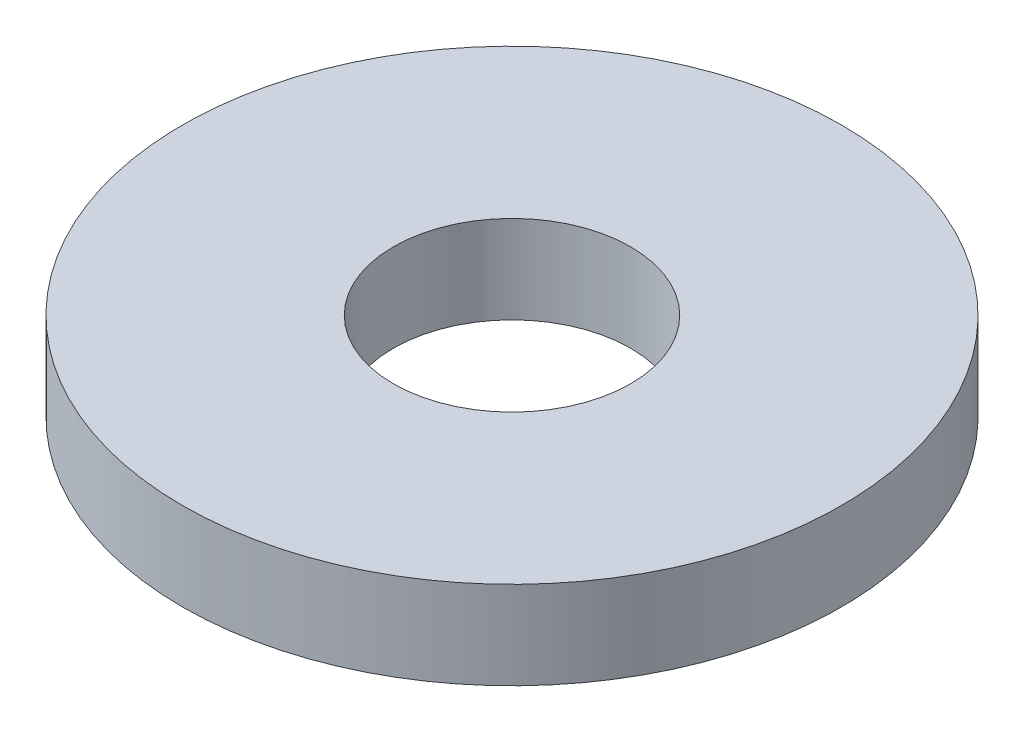
ISO-10303-21;
HEADER;
FILE_DESCRIPTION(('STEP AP214'),'2;1');
FILE_NAME('part.step','',(''),(''),'','','');
FILE_SCHEMA(('AUTOMOTIVE_DESIGN { 1 0 10303 214 1 1 1 1 }'));
ENDSEC;
DATA;
#1=APPLICATION_CONTEXT('core data for automotive mechanical design processes');
#2=APPLICATION_PROTOCOL_DEFINITION('international standard','automotive_design',2000,#1);
#3=PRODUCT_CONTEXT('',#1,'mechanical');
#4=PRODUCT('Part','Part','',(#3));
#5=PRODUCT_RELATED_PRODUCT_CATEGORY('part','',(#4));
#6=PRODUCT_DEFINITION_FORMATION('','',#4);
#7=PRODUCT_DEFINITION_CONTEXT('part definition',#1,'design');
#8=PRODUCT_DEFINITION('design','',#6,#7);
#9=PRODUCT_DEFINITION_SHAPE('','',#8);
#10=(LENGTH_UNIT() NAMED_UNIT(*) SI_UNIT(.MILLI.,.METRE.));
#11=(NAMED_UNIT(*) PLANE_ANGLE_UNIT() SI_UNIT($,.RADIAN.));
#12=(NAMED_UNIT(*) SI_UNIT($,.STERADIAN.) SOLID_ANGLE_UNIT());
#13=UNCERTAINTY_MEASURE_WITH_UNIT(LENGTH_MEASURE(1.E-05),#10,'distance_accuracy_value','');
#14=(GEOMETRIC_REPRESENTATION_CONTEXT(3) GLOBAL_UNCERTAINTY_ASSIGNED_CONTEXT((#13)) GLOBAL_UNIT_ASSIGNED_CONTEXT((#10,
#11,#12)) REPRESENTATION_CONTEXT('',''));
#15=CARTESIAN_POINT('',(0.,0.,0.));
#16=DIRECTION('',(0.,0.,1.));
#17=DIRECTION('',(1.,0.,0.));
#18=AXIS2_PLACEMENT_3D('',#15,#16,#17);
#19=CARTESIAN_POINT('',(0.,2.,0.));
#20=DIRECTION('',(0.,1.,0.));
#21=DIRECTION('',(0.,0.,1.));
#22=AXIS2_PLACEMENT_3D('',#19,#20,#21);
#23=PLANE('',#22);
#24=CARTESIAN_POINT('',(0.,2.,0.));
#25=DIRECTION('',(0.,1.,0.));
#26=DIRECTION('',(0.,0.,1.));
#27=AXIS2_PLACEMENT_3D('',#24,#25,#26);
#28=CIRCLE('',#27,7.5);
#29=CARTESIAN_POINT('',(0.,2.,7.5));
#30=VERTEX_POINT('',#29);
#31=EDGE_CURVE('E10',#30,#30,#28,.T.);
#32=ORIENTED_EDGE('',*,*,#31,.T.);
#33=EDGE_LOOP('',(#32));
#34=FACE_BOUND('',#33,.T.);
#35=CARTESIAN_POINT('',(0.,2.,0.));
#36=DIRECTION('',(0.,1.,0.));
#37=DIRECTION('',(0.,0.,1.));
#38=AXIS2_PLACEMENT_3D('',#35,#36,#37);
#39=CIRCLE('',#38,2.7);
#40=CARTESIAN_POINT('',(0.,2.,2.7));
#41=VERTEX_POINT('',#40);
#42=EDGE_CURVE('E43',#41,#41,#39,.T.);
#43=ORIENTED_EDGE('',*,*,#42,.F.);
#44=EDGE_LOOP('',(#43));
#45=FACE_BOUND('',#44,.T.);
#46=ADVANCED_FACE('F32',(#34,#45),#23,.T.);
#47=CARTESIAN_POINT('',(0.,0.,0.));
#48=DIRECTION('',(0.,1.,0.));
#49=DIRECTION('',(0.,0.,1.));
#50=AXIS2_PLACEMENT_3D('',#47,#48,#49);
#51=PLANE('',#50);
#52=CARTESIAN_POINT('',(0.,0.,0.));
#53=DIRECTION('',(0.,1.,0.));
#54=DIRECTION('',(0.,0.,1.));
#55=AXIS2_PLACEMENT_3D('',#52,#53,#54);
#56=CIRCLE('',#55,7.5);
#57=CARTESIAN_POINT('',(0.,0.,7.5));
#58=VERTEX_POINT('',#57);
#59=EDGE_CURVE('E36',#58,#58,#56,.T.);
#60=ORIENTED_EDGE('',*,*,#59,.F.);
#61=EDGE_LOOP('',(#60));
#62=FACE_BOUND('',#61,.T.);
#63=CARTESIAN_POINT('',(0.,0.,0.));
#64=DIRECTION('',(0.,1.,0.));
#65=DIRECTION('',(0.,0.,1.));
#66=AXIS2_PLACEMENT_3D('',#63,#64,#65);
#67=CIRCLE('',#66,2.7);
#68=CARTESIAN_POINT('',(0.,0.,2.7));
#69=VERTEX_POINT('',#68);
#70=EDGE_CURVE('E45',#69,#69,#67,.T.);
#71=ORIENTED_EDGE('',*,*,#70,.T.);
#72=EDGE_LOOP('',(#71));
#73=FACE_BOUND('',#72,.T.);
#74=ADVANCED_FACE('F55',(#62,#73),#51,.F.);
#75=CARTESIAN_POINT('',(0.,2.,0.));
#76=DIRECTION('',(0.,-1.,0.));
#77=DIRECTION('',(0.,0.,-1.));
#78=AXIS2_PLACEMENT_3D('',#75,#76,#77);
#79=CYLINDRICAL_SURFACE('',#78,7.5);
#80=ORIENTED_EDGE('',*,*,#31,.F.);
#81=EDGE_LOOP('',(#80));
#82=FACE_BOUND('',#81,.T.);
#83=ORIENTED_EDGE('',*,*,#59,.T.);
#84=EDGE_LOOP('',(#83));
#85=FACE_BOUND('',#84,.T.);
#86=ADVANCED_FACE('F34',(#82,#85),#79,.T.);
#87=CARTESIAN_POINT('',(0.,2.,0.));
#88=DIRECTION('',(0.,-1.,0.));
#89=DIRECTION('',(0.,0.,-1.));
#90=AXIS2_PLACEMENT_3D('',#87,#88,#89);
#91=CYLINDRICAL_SURFACE('',#90,2.7);
#92=ORIENTED_EDGE('',*,*,#42,.T.);
#93=EDGE_LOOP('',(#92));
#94=FACE_BOUND('',#93,.T.);
#95=ORIENTED_EDGE('',*,*,#70,.F.);
#96=EDGE_LOOP('',(#95));
#97=FACE_BOUND('',#96,.T.);
#98=ADVANCED_FACE('F51',(#94,#97),#91,.F.);
#99=CLOSED_SHELL('',(#46,#74,#86,#98));
#100=MANIFOLD_SOLID_BREP('B2',#99);
#101=ADVANCED_BREP_SHAPE_REPRESENTATION('',(#18,#100),#14);
#102=SHAPE_DEFINITION_REPRESENTATION(#9,#101);
ENDSEC;
END-ISO-10303-21;
